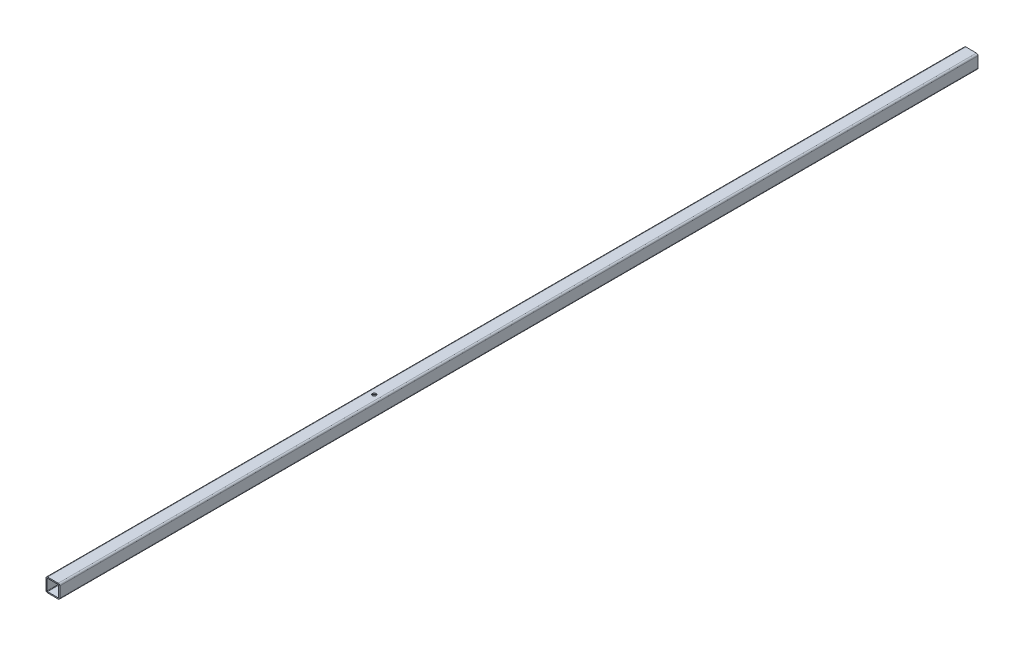
ISO-10303-21;
HEADER;
FILE_DESCRIPTION(('STEP AP214'),'2;1');
FILE_NAME('part.step','',(''),(''),'','','');
FILE_SCHEMA(('AUTOMOTIVE_DESIGN { 1 0 10303 214 1 1 1 1 }'));
ENDSEC;
DATA;
#1=APPLICATION_CONTEXT('core data for automotive mechanical design processes');
#2=APPLICATION_PROTOCOL_DEFINITION('international standard','automotive_design',2000,#1);
#3=PRODUCT_CONTEXT('',#1,'mechanical');
#4=PRODUCT('Part','Part','',(#3));
#5=PRODUCT_RELATED_PRODUCT_CATEGORY('part','',(#4));
#6=PRODUCT_DEFINITION_FORMATION('','',#4);
#7=PRODUCT_DEFINITION_CONTEXT('part definition',#1,'design');
#8=PRODUCT_DEFINITION('design','',#6,#7);
#9=PRODUCT_DEFINITION_SHAPE('','',#8);
#10=(LENGTH_UNIT() NAMED_UNIT(*) SI_UNIT(.MILLI.,.METRE.));
#11=(NAMED_UNIT(*) PLANE_ANGLE_UNIT() SI_UNIT($,.RADIAN.));
#12=(NAMED_UNIT(*) SI_UNIT($,.STERADIAN.) SOLID_ANGLE_UNIT());
#13=UNCERTAINTY_MEASURE_WITH_UNIT(LENGTH_MEASURE(1.E-05),#10,'distance_accuracy_value','');
#14=(GEOMETRIC_REPRESENTATION_CONTEXT(3) GLOBAL_UNCERTAINTY_ASSIGNED_CONTEXT((#13)) GLOBAL_UNIT_ASSIGNED_CONTEXT((#10,
#11,#12)) REPRESENTATION_CONTEXT('',''));
#15=CARTESIAN_POINT('',(0.,0.,0.));
#16=DIRECTION('',(0.,0.,1.));
#17=DIRECTION('',(1.,0.,0.));
#18=AXIS2_PLACEMENT_3D('',#15,#16,#17);
#19=CARTESIAN_POINT('',(-5.80000000000002,5.79999999999996,1000.));
#20=DIRECTION('',(0.,0.,1.));
#21=DIRECTION('',(1.,0.,0.));
#22=AXIS2_PLACEMENT_3D('',#19,#20,#21);
#23=PLANE('',#22);
#24=CARTESIAN_POINT('',(-5.80000000000002,5.79999999999996,1000.));
#25=DIRECTION('',(0.,0.,1.));
#26=DIRECTION('',(1.,0.,0.));
#27=AXIS2_PLACEMENT_3D('',#24,#25,#26);
#28=CIRCLE('',#27,1.7);
#29=CARTESIAN_POINT('',(-5.80000000000003,7.49999999999995,1000.));
#30=VERTEX_POINT('',#29);
#31=CARTESIAN_POINT('',(-7.50000000000002,5.79999999999995,1000.));
#32=VERTEX_POINT('',#31);
#33=EDGE_CURVE('E214',#30,#32,#28,.T.);
#34=ORIENTED_EDGE('',*,*,#33,.T.);
#35=DIRECTION('',(0.,-1.,0.));
#36=VECTOR('',#35,1.);
#37=CARTESIAN_POINT('',(-7.50000000000002,5.79999999999995,1000.));
#38=LINE('',#37,#36);
#39=CARTESIAN_POINT('',(-7.49999999999998,-5.79999999999995,1000.));
#40=VERTEX_POINT('',#39);
#41=EDGE_CURVE('E217',#32,#40,#38,.T.);
#42=ORIENTED_EDGE('',*,*,#41,.T.);
#43=CARTESIAN_POINT('',(-5.79999999999987,-5.79999999999994,1000.));
#44=DIRECTION('',(0.,0.,1.));
#45=DIRECTION('',(1.,0.,0.));
#46=AXIS2_PLACEMENT_3D('',#43,#44,#45);
#47=CIRCLE('',#46,1.70000000000011);
#48=CARTESIAN_POINT('',(-5.79999999999987,-7.50000000000005,1000.));
#49=VERTEX_POINT('',#48);
#50=EDGE_CURVE('E220',#40,#49,#47,.T.);
#51=ORIENTED_EDGE('',*,*,#50,.T.);
#52=DIRECTION('',(1.,0.,0.));
#53=VECTOR('',#52,1.);
#54=CARTESIAN_POINT('',(-5.79999999999987,-7.50000000000005,1000.));
#55=LINE('',#54,#53);
#56=CARTESIAN_POINT('',(5.7999999999999,-7.50000000000001,1000.));
#57=VERTEX_POINT('',#56);
#58=EDGE_CURVE('E222',#49,#57,#55,.T.);
#59=ORIENTED_EDGE('',*,*,#58,.T.);
#60=CARTESIAN_POINT('',(5.79999999999991,-5.7999999999999,1000.));
#61=DIRECTION('',(0.,0.,1.));
#62=DIRECTION('',(1.,0.,0.));
#63=AXIS2_PLACEMENT_3D('',#60,#61,#62);
#64=CIRCLE('',#63,1.70000000000011);
#65=CARTESIAN_POINT('',(7.50000000000002,-5.79999999999988,1000.));
#66=VERTEX_POINT('',#65);
#67=EDGE_CURVE('E224',#57,#66,#64,.T.);
#68=ORIENTED_EDGE('',*,*,#67,.T.);
#69=DIRECTION('',(0.,1.,0.));
#70=VECTOR('',#69,1.);
#71=CARTESIAN_POINT('',(7.49999999999997,5.8,1000.));
#72=LINE('',#71,#70);
#73=CARTESIAN_POINT('',(7.49999999999998,5.8,1000.));
#74=VERTEX_POINT('',#73);
#75=EDGE_CURVE('E226',#66,#74,#72,.T.);
#76=ORIENTED_EDGE('',*,*,#75,.T.);
#77=CARTESIAN_POINT('',(5.79999999999998,5.8,1000.));
#78=DIRECTION('',(0.,0.,1.));
#79=DIRECTION('',(-1.,0.,0.));
#80=AXIS2_PLACEMENT_3D('',#77,#78,#79);
#81=CIRCLE('',#80,1.7);
#82=CARTESIAN_POINT('',(5.79999999999997,7.5,1000.));
#83=VERTEX_POINT('',#82);
#84=EDGE_CURVE('E228',#74,#83,#81,.T.);
#85=ORIENTED_EDGE('',*,*,#84,.T.);
#86=DIRECTION('',(-1.,0.,0.));
#87=VECTOR('',#86,1.);
#88=CARTESIAN_POINT('',(-5.80000000000003,7.49999999999995,1000.));
#89=LINE('',#88,#87);
#90=EDGE_CURVE('E230',#83,#30,#89,.T.);
#91=ORIENTED_EDGE('',*,*,#90,.T.);
#92=EDGE_LOOP('',(#34,#42,#51,#59,#68,#76,#85,#91));
#93=FACE_BOUND('',#92,.T.);
#94=DIRECTION('',(0.,-1.,0.));
#95=VECTOR('',#94,1.);
#96=CARTESIAN_POINT('',(-6.29999999999991,5.79999999999995,1000.));
#97=LINE('',#96,#95);
#98=CARTESIAN_POINT('',(-6.29999999999991,5.79999999999995,1000.));
#99=VERTEX_POINT('',#98);
#100=CARTESIAN_POINT('',(-6.29999999999986,-5.79999999999995,1000.));
#101=VERTEX_POINT('',#100);
#102=EDGE_CURVE('E155',#99,#101,#97,.T.);
#103=ORIENTED_EDGE('',*,*,#102,.F.);
#104=CARTESIAN_POINT('',(-5.79999999999991,5.79999999999995,1000.));
#105=DIRECTION('',(0.,0.,1.));
#106=DIRECTION('',(-1.,0.,0.));
#107=AXIS2_PLACEMENT_3D('',#104,#105,#106);
#108=CIRCLE('',#107,0.500000000000001);
#109=CARTESIAN_POINT('',(-5.79999999999982,6.29999999999995,1000.));
#110=VERTEX_POINT('',#109);
#111=EDGE_CURVE('E147',#110,#99,#108,.T.);
#112=ORIENTED_EDGE('',*,*,#111,.F.);
#113=DIRECTION('',(-1.,0.,0.));
#114=VECTOR('',#113,1.);
#115=CARTESIAN_POINT('',(5.79999999999987,6.29999999999999,1000.));
#116=LINE('',#115,#114);
#117=CARTESIAN_POINT('',(5.79999999999986,6.29999999999999,1000.));
#118=VERTEX_POINT('',#117);
#119=EDGE_CURVE('E181',#118,#110,#116,.T.);
#120=ORIENTED_EDGE('',*,*,#119,.F.);
#121=CARTESIAN_POINT('',(5.79999999999987,5.79999999999977,1000.));
#122=DIRECTION('',(0.,0.,1.));
#123=DIRECTION('',(-1.,0.,0.));
#124=AXIS2_PLACEMENT_3D('',#121,#122,#123);
#125=CIRCLE('',#124,0.500000000000359);
#126=CARTESIAN_POINT('',(6.30000000000036,5.79999999999941,1000.));
#127=VERTEX_POINT('',#126);
#128=EDGE_CURVE('E179',#127,#118,#125,.T.);
#129=ORIENTED_EDGE('',*,*,#128,.F.);
#130=DIRECTION('',(0.,1.,0.));
#131=VECTOR('',#130,1.);
#132=CARTESIAN_POINT('',(6.30000000000041,-5.79999999999941,1000.));
#133=LINE('',#132,#131);
#134=CARTESIAN_POINT('',(6.30000000000027,-5.79999999999941,1000.));
#135=VERTEX_POINT('',#134);
#136=EDGE_CURVE('E177',#135,#127,#133,.T.);
#137=ORIENTED_EDGE('',*,*,#136,.F.);
#138=CARTESIAN_POINT('',(5.79999999999998,-5.79999999999978,1000.));
#139=DIRECTION('',(0.,0.,1.));
#140=DIRECTION('',(1.,0.,0.));
#141=AXIS2_PLACEMENT_3D('',#138,#139,#140);
#142=CIRCLE('',#141,0.500000000000293);
#143=CARTESIAN_POINT('',(5.79999999999998,-6.29999999999993,1000.));
#144=VERTEX_POINT('',#143);
#145=EDGE_CURVE('E175',#144,#135,#142,.T.);
#146=ORIENTED_EDGE('',*,*,#145,.F.);
#147=DIRECTION('',(1.,0.,0.));
#148=VECTOR('',#147,1.);
#149=CARTESIAN_POINT('',(-5.79999999999994,-6.29999999999997,1000.));
#150=LINE('',#149,#148);
#151=CARTESIAN_POINT('',(-5.79999999999994,-6.29999999999997,1000.));
#152=VERTEX_POINT('',#151);
#153=EDGE_CURVE('E170',#152,#144,#150,.T.);
#154=ORIENTED_EDGE('',*,*,#153,.F.);
#155=CARTESIAN_POINT('',(-5.79999999999994,-5.80000000000004,1000.));
#156=DIRECTION('',(0.,0.,1.));
#157=DIRECTION('',(-1.,0.,0.));
#158=AXIS2_PLACEMENT_3D('',#155,#156,#157);
#159=CIRCLE('',#158,0.499999999999926);
#160=EDGE_CURVE('E168',#101,#152,#159,.T.);
#161=ORIENTED_EDGE('',*,*,#160,.F.);
#162=EDGE_LOOP('',(#103,#112,#120,#129,#137,#146,#154,#161));
#163=FACE_BOUND('',#162,.T.);
#164=ADVANCED_FACE('F32',(#93,#163),#23,.T.);
#165=CARTESIAN_POINT('',(-5.80000000000002,5.79999999999996,0.));
#166=DIRECTION('',(0.,0.,1.));
#167=DIRECTION('',(1.,0.,0.));
#168=AXIS2_PLACEMENT_3D('',#165,#166,#167);
#169=PLANE('',#168);
#170=CARTESIAN_POINT('',(-5.80000000000002,5.79999999999996,0.));
#171=DIRECTION('',(0.,0.,1.));
#172=DIRECTION('',(1.,0.,0.));
#173=AXIS2_PLACEMENT_3D('',#170,#171,#172);
#174=CIRCLE('',#173,1.7);
#175=CARTESIAN_POINT('',(-5.80000000000003,7.49999999999995,0.));
#176=VERTEX_POINT('',#175);
#177=CARTESIAN_POINT('',(-7.50000000000002,5.79999999999995,0.));
#178=VERTEX_POINT('',#177);
#179=EDGE_CURVE('E163',#176,#178,#174,.T.);
#180=ORIENTED_EDGE('',*,*,#179,.F.);
#181=DIRECTION('',(-1.,0.,0.));
#182=VECTOR('',#181,1.);
#183=CARTESIAN_POINT('',(-5.80000000000003,7.49999999999995,0.));
#184=LINE('',#183,#182);
#185=CARTESIAN_POINT('',(5.79999999999997,7.5,0.));
#186=VERTEX_POINT('',#185);
#187=EDGE_CURVE('E218',#186,#176,#184,.T.);
#188=ORIENTED_EDGE('',*,*,#187,.F.);
#189=CARTESIAN_POINT('',(5.79999999999998,5.8,0.));
#190=DIRECTION('',(0.,0.,1.));
#191=DIRECTION('',(-1.,0.,0.));
#192=AXIS2_PLACEMENT_3D('',#189,#190,#191);
#193=CIRCLE('',#192,1.7);
#194=CARTESIAN_POINT('',(7.49999999999998,5.8,0.));
#195=VERTEX_POINT('',#194);
#196=EDGE_CURVE('E245',#195,#186,#193,.T.);
#197=ORIENTED_EDGE('',*,*,#196,.F.);
#198=DIRECTION('',(0.,1.,0.));
#199=VECTOR('',#198,1.);
#200=CARTESIAN_POINT('',(7.49999999999997,5.8,0.));
#201=LINE('',#200,#199);
#202=CARTESIAN_POINT('',(7.50000000000002,-5.79999999999988,0.));
#203=VERTEX_POINT('',#202);
#204=EDGE_CURVE('E243',#203,#195,#201,.T.);
#205=ORIENTED_EDGE('',*,*,#204,.F.);
#206=CARTESIAN_POINT('',(5.79999999999991,-5.7999999999999,0.));
#207=DIRECTION('',(0.,0.,1.));
#208=DIRECTION('',(1.,0.,0.));
#209=AXIS2_PLACEMENT_3D('',#206,#207,#208);
#210=CIRCLE('',#209,1.70000000000011);
#211=CARTESIAN_POINT('',(5.7999999999999,-7.50000000000001,0.));
#212=VERTEX_POINT('',#211);
#213=EDGE_CURVE('E241',#212,#203,#210,.T.);
#214=ORIENTED_EDGE('',*,*,#213,.F.);
#215=DIRECTION('',(1.,0.,0.));
#216=VECTOR('',#215,1.);
#217=CARTESIAN_POINT('',(-5.79999999999987,-7.50000000000005,0.));
#218=LINE('',#217,#216);
#219=CARTESIAN_POINT('',(-5.79999999999987,-7.50000000000005,0.));
#220=VERTEX_POINT('',#219);
#221=EDGE_CURVE('E239',#220,#212,#218,.T.);
#222=ORIENTED_EDGE('',*,*,#221,.F.);
#223=CARTESIAN_POINT('',(-5.79999999999987,-5.79999999999994,0.));
#224=DIRECTION('',(0.,0.,1.));
#225=DIRECTION('',(1.,0.,0.));
#226=AXIS2_PLACEMENT_3D('',#223,#224,#225);
#227=CIRCLE('',#226,1.70000000000011);
#228=CARTESIAN_POINT('',(-7.49999999999998,-5.79999999999995,0.));
#229=VERTEX_POINT('',#228);
#230=EDGE_CURVE('E237',#229,#220,#227,.T.);
#231=ORIENTED_EDGE('',*,*,#230,.F.);
#232=DIRECTION('',(0.,-1.,0.));
#233=VECTOR('',#232,1.);
#234=CARTESIAN_POINT('',(-7.50000000000002,5.79999999999995,0.));
#235=LINE('',#234,#233);
#236=EDGE_CURVE('E235',#178,#229,#235,.T.);
#237=ORIENTED_EDGE('',*,*,#236,.F.);
#238=EDGE_LOOP('',(#180,#188,#197,#205,#214,#222,#231,#237));
#239=FACE_BOUND('',#238,.T.);
#240=CARTESIAN_POINT('',(-5.79999999999991,5.79999999999995,0.));
#241=DIRECTION('',(0.,0.,1.));
#242=DIRECTION('',(-1.,0.,0.));
#243=AXIS2_PLACEMENT_3D('',#240,#241,#242);
#244=CIRCLE('',#243,0.500000000000001);
#245=CARTESIAN_POINT('',(-5.79999999999982,6.29999999999995,0.));
#246=VERTEX_POINT('',#245);
#247=CARTESIAN_POINT('',(-6.29999999999991,5.79999999999995,0.));
#248=VERTEX_POINT('',#247);
#249=EDGE_CURVE('E57',#246,#248,#244,.T.);
#250=ORIENTED_EDGE('',*,*,#249,.T.);
#251=DIRECTION('',(0.,-1.,0.));
#252=VECTOR('',#251,1.);
#253=CARTESIAN_POINT('',(-6.29999999999991,5.79999999999995,0.));
#254=LINE('',#253,#252);
#255=CARTESIAN_POINT('',(-6.29999999999986,-5.79999999999995,0.));
#256=VERTEX_POINT('',#255);
#257=EDGE_CURVE('E162',#248,#256,#254,.T.);
#258=ORIENTED_EDGE('',*,*,#257,.T.);
#259=CARTESIAN_POINT('',(-5.79999999999994,-5.80000000000004,0.));
#260=DIRECTION('',(0.,0.,1.));
#261=DIRECTION('',(-1.,0.,0.));
#262=AXIS2_PLACEMENT_3D('',#259,#260,#261);
#263=CIRCLE('',#262,0.499999999999926);
#264=CARTESIAN_POINT('',(-5.79999999999994,-6.29999999999997,0.));
#265=VERTEX_POINT('',#264);
#266=EDGE_CURVE('E186',#256,#265,#263,.T.);
#267=ORIENTED_EDGE('',*,*,#266,.T.);
#268=DIRECTION('',(1.,0.,0.));
#269=VECTOR('',#268,1.);
#270=CARTESIAN_POINT('',(-5.79999999999994,-6.29999999999997,0.));
#271=LINE('',#270,#269);
#272=CARTESIAN_POINT('',(5.79999999999998,-6.29999999999993,0.));
#273=VERTEX_POINT('',#272);
#274=EDGE_CURVE('E189',#265,#273,#271,.T.);
#275=ORIENTED_EDGE('',*,*,#274,.T.);
#276=CARTESIAN_POINT('',(5.79999999999998,-5.79999999999978,0.));
#277=DIRECTION('',(0.,0.,1.));
#278=DIRECTION('',(1.,0.,0.));
#279=AXIS2_PLACEMENT_3D('',#276,#277,#278);
#280=CIRCLE('',#279,0.500000000000293);
#281=CARTESIAN_POINT('',(6.30000000000027,-5.79999999999941,0.));
#282=VERTEX_POINT('',#281);
#283=EDGE_CURVE('E192',#273,#282,#280,.T.);
#284=ORIENTED_EDGE('',*,*,#283,.T.);
#285=DIRECTION('',(0.,1.,0.));
#286=VECTOR('',#285,1.);
#287=CARTESIAN_POINT('',(6.30000000000041,-5.79999999999941,0.));
#288=LINE('',#287,#286);
#289=CARTESIAN_POINT('',(6.30000000000036,5.79999999999941,0.));
#290=VERTEX_POINT('',#289);
#291=EDGE_CURVE('E195',#282,#290,#288,.T.);
#292=ORIENTED_EDGE('',*,*,#291,.T.);
#293=CARTESIAN_POINT('',(5.79999999999987,5.79999999999977,0.));
#294=DIRECTION('',(0.,0.,1.));
#295=DIRECTION('',(-1.,0.,0.));
#296=AXIS2_PLACEMENT_3D('',#293,#294,#295);
#297=CIRCLE('',#296,0.500000000000359);
#298=CARTESIAN_POINT('',(5.79999999999987,6.30000000000013,0.));
#299=VERTEX_POINT('',#298);
#300=EDGE_CURVE('E198',#290,#299,#297,.T.);
#301=ORIENTED_EDGE('',*,*,#300,.T.);
#302=DIRECTION('',(-1.,0.,0.));
#303=VECTOR('',#302,1.);
#304=CARTESIAN_POINT('',(5.79999999999987,6.29999999999999,0.));
#305=LINE('',#304,#303);
#306=EDGE_CURVE('E156',#299,#246,#305,.T.);
#307=ORIENTED_EDGE('',*,*,#306,.T.);
#308=EDGE_LOOP('',(#250,#258,#267,#275,#284,#292,#301,#307));
#309=FACE_BOUND('',#308,.T.);
#310=ADVANCED_FACE('F296',(#239,#309),#169,.F.);
#311=CARTESIAN_POINT('',(-5.80000000000002,5.79999999999996,1000.));
#312=DIRECTION('',(0.,0.,-1.));
#313=DIRECTION('',(-1.,0.,0.));
#314=AXIS2_PLACEMENT_3D('',#311,#312,#313);
#315=CYLINDRICAL_SURFACE('',#314,1.7);
#316=ORIENTED_EDGE('',*,*,#179,.T.);
#317=DIRECTION('',(0.,0.,-1.));
#318=VECTOR('',#317,1.);
#319=CARTESIAN_POINT('',(-7.50000000000002,5.79999999999995,1000.));
#320=LINE('',#319,#318);
#321=EDGE_CURVE('E11',#32,#178,#320,.T.);
#322=ORIENTED_EDGE('',*,*,#321,.F.);
#323=ORIENTED_EDGE('',*,*,#33,.F.);
#324=DIRECTION('',(0.,0.,-1.));
#325=VECTOR('',#324,1.);
#326=CARTESIAN_POINT('',(-5.80000000000003,7.49999999999995,1000.));
#327=LINE('',#326,#325);
#328=EDGE_CURVE('E232',#30,#176,#327,.T.);
#329=ORIENTED_EDGE('',*,*,#328,.T.);
#330=EDGE_LOOP('',(#316,#322,#323,#329));
#331=FACE_BOUND('',#330,.T.);
#332=ADVANCED_FACE('F34',(#331),#315,.T.);
#333=CARTESIAN_POINT('',(-7.50000000000002,5.79999999999995,1000.));
#334=DIRECTION('',(1.,0.,0.));
#335=DIRECTION('',(0.,1.,0.));
#336=AXIS2_PLACEMENT_3D('',#333,#334,#335);
#337=PLANE('',#336);
#338=CARTESIAN_POINT('',(-7.5,0.,697.));
#339=DIRECTION('',(-1.,0.,0.));
#340=DIRECTION('',(0.,-1.,0.));
#341=AXIS2_PLACEMENT_3D('',#338,#339,#340);
#342=CIRCLE('',#341,2.);
#343=CARTESIAN_POINT('',(-7.49999999999999,-2.00000000000005,697.));
#344=VERTEX_POINT('',#343);
#345=EDGE_CURVE('E267',#344,#344,#342,.T.);
#346=ORIENTED_EDGE('',*,*,#345,.F.);
#347=EDGE_LOOP('',(#346));
#348=FACE_BOUND('',#347,.T.);
#349=ORIENTED_EDGE('',*,*,#236,.T.);
#350=DIRECTION('',(0.,0.,-1.));
#351=VECTOR('',#350,1.);
#352=CARTESIAN_POINT('',(-7.49999999999998,-5.79999999999995,1000.));
#353=LINE('',#352,#351);
#354=EDGE_CURVE('E41',#40,#229,#353,.T.);
#355=ORIENTED_EDGE('',*,*,#354,.F.);
#356=ORIENTED_EDGE('',*,*,#41,.F.);
#357=ORIENTED_EDGE('',*,*,#321,.T.);
#358=EDGE_LOOP('',(#349,#355,#356,#357));
#359=FACE_BOUND('',#358,.T.);
#360=ADVANCED_FACE('F302',(#348,#359),#337,.F.);
#361=CARTESIAN_POINT('',(-5.79999999999987,-5.79999999999994,1000.));
#362=DIRECTION('',(0.,0.,-1.));
#363=DIRECTION('',(-1.,0.,0.));
#364=AXIS2_PLACEMENT_3D('',#361,#362,#363);
#365=CYLINDRICAL_SURFACE('',#364,1.70000000000011);
#366=ORIENTED_EDGE('',*,*,#230,.T.);
#367=DIRECTION('',(0.,0.,-1.));
#368=VECTOR('',#367,1.);
#369=CARTESIAN_POINT('',(-5.79999999999987,-7.50000000000005,1000.));
#370=LINE('',#369,#368);
#371=EDGE_CURVE('E262',#49,#220,#370,.T.);
#372=ORIENTED_EDGE('',*,*,#371,.F.);
#373=ORIENTED_EDGE('',*,*,#50,.F.);
#374=ORIENTED_EDGE('',*,*,#354,.T.);
#375=EDGE_LOOP('',(#366,#372,#373,#374));
#376=FACE_BOUND('',#375,.T.);
#377=ADVANCED_FACE('F323',(#376),#365,.T.);
#378=CARTESIAN_POINT('',(-5.79999999999987,-7.50000000000005,1000.));
#379=DIRECTION('',(0.,1.,0.));
#380=DIRECTION('',(-1.,0.,0.));
#381=AXIS2_PLACEMENT_3D('',#378,#379,#380);
#382=PLANE('',#381);
#383=ORIENTED_EDGE('',*,*,#221,.T.);
#384=DIRECTION('',(0.,0.,-1.));
#385=VECTOR('',#384,1.);
#386=CARTESIAN_POINT('',(5.7999999999999,-7.50000000000001,1000.));
#387=LINE('',#386,#385);
#388=EDGE_CURVE('E259',#57,#212,#387,.T.);
#389=ORIENTED_EDGE('',*,*,#388,.F.);
#390=ORIENTED_EDGE('',*,*,#58,.F.);
#391=ORIENTED_EDGE('',*,*,#371,.T.);
#392=EDGE_LOOP('',(#383,#389,#390,#391));
#393=FACE_BOUND('',#392,.T.);
#394=ADVANCED_FACE('F320',(#393),#382,.F.);
#395=CARTESIAN_POINT('',(5.79999999999991,-5.7999999999999,1000.));
#396=DIRECTION('',(0.,0.,-1.));
#397=DIRECTION('',(-1.,0.,0.));
#398=AXIS2_PLACEMENT_3D('',#395,#396,#397);
#399=CYLINDRICAL_SURFACE('',#398,1.70000000000011);
#400=ORIENTED_EDGE('',*,*,#213,.T.);
#401=DIRECTION('',(0.,0.,-1.));
#402=VECTOR('',#401,1.);
#403=CARTESIAN_POINT('',(7.50000000000002,-5.79999999999988,1000.));
#404=LINE('',#403,#402);
#405=EDGE_CURVE('E256',#66,#203,#404,.T.);
#406=ORIENTED_EDGE('',*,*,#405,.F.);
#407=ORIENTED_EDGE('',*,*,#67,.F.);
#408=ORIENTED_EDGE('',*,*,#388,.T.);
#409=EDGE_LOOP('',(#400,#406,#407,#408));
#410=FACE_BOUND('',#409,.T.);
#411=ADVANCED_FACE('F316',(#410),#399,.T.);
#412=CARTESIAN_POINT('',(7.49999999999997,5.8,1000.));
#413=DIRECTION('',(-1.,0.,0.));
#414=DIRECTION('',(0.,-1.,0.));
#415=AXIS2_PLACEMENT_3D('',#412,#413,#414);
#416=PLANE('',#415);
#417=ORIENTED_EDGE('',*,*,#204,.T.);
#418=DIRECTION('',(0.,0.,-1.));
#419=VECTOR('',#418,1.);
#420=CARTESIAN_POINT('',(7.49999999999998,5.8,1000.));
#421=LINE('',#420,#419);
#422=EDGE_CURVE('E253',#74,#195,#421,.T.);
#423=ORIENTED_EDGE('',*,*,#422,.F.);
#424=ORIENTED_EDGE('',*,*,#75,.F.);
#425=ORIENTED_EDGE('',*,*,#405,.T.);
#426=EDGE_LOOP('',(#417,#423,#424,#425));
#427=FACE_BOUND('',#426,.T.);
#428=ADVANCED_FACE('F312',(#427),#416,.F.);
#429=CARTESIAN_POINT('',(5.79999999999998,5.8,1000.));
#430=DIRECTION('',(0.,0.,-1.));
#431=DIRECTION('',(-1.,0.,0.));
#432=AXIS2_PLACEMENT_3D('',#429,#430,#431);
#433=CYLINDRICAL_SURFACE('',#432,1.7);
#434=ORIENTED_EDGE('',*,*,#196,.T.);
#435=DIRECTION('',(0.,0.,-1.));
#436=VECTOR('',#435,1.);
#437=CARTESIAN_POINT('',(5.79999999999997,7.5,1000.));
#438=LINE('',#437,#436);
#439=EDGE_CURVE('E250',#83,#186,#438,.T.);
#440=ORIENTED_EDGE('',*,*,#439,.F.);
#441=ORIENTED_EDGE('',*,*,#84,.F.);
#442=ORIENTED_EDGE('',*,*,#422,.T.);
#443=EDGE_LOOP('',(#434,#440,#441,#442));
#444=FACE_BOUND('',#443,.T.);
#445=ADVANCED_FACE('F284',(#444),#433,.T.);
#446=CARTESIAN_POINT('',(-5.80000000000003,7.49999999999995,1000.));
#447=DIRECTION('',(0.,-1.,0.));
#448=DIRECTION('',(1.,0.,0.));
#449=AXIS2_PLACEMENT_3D('',#446,#447,#448);
#450=PLANE('',#449);
#451=CARTESIAN_POINT('',(0.,7.49999999999998,650.));
#452=DIRECTION('',(0.,1.,0.));
#453=DIRECTION('',(-1.,0.,0.));
#454=AXIS2_PLACEMENT_3D('',#451,#452,#453);
#455=CIRCLE('',#454,2.00000000000001);
#456=CARTESIAN_POINT('',(-2.00000000000007,7.49999999999997,650.));
#457=VERTEX_POINT('',#456);
#458=EDGE_CURVE('E274',#457,#457,#455,.T.);
#459=ORIENTED_EDGE('',*,*,#458,.F.);
#460=EDGE_LOOP('',(#459));
#461=FACE_BOUND('',#460,.T.);
#462=ORIENTED_EDGE('',*,*,#187,.T.);
#463=ORIENTED_EDGE('',*,*,#328,.F.);
#464=ORIENTED_EDGE('',*,*,#90,.F.);
#465=ORIENTED_EDGE('',*,*,#439,.T.);
#466=EDGE_LOOP('',(#462,#463,#464,#465));
#467=FACE_BOUND('',#466,.T.);
#468=ADVANCED_FACE('F281',(#461,#467),#450,.F.);
#469=CARTESIAN_POINT('',(-5.79999999999991,5.79999999999995,1000.));
#470=DIRECTION('',(0.,0.,-1.));
#471=DIRECTION('',(-1.,0.,0.));
#472=AXIS2_PLACEMENT_3D('',#469,#470,#471);
#473=CYLINDRICAL_SURFACE('',#472,0.500000000000001);
#474=ORIENTED_EDGE('',*,*,#249,.F.);
#475=DIRECTION('',(0.,0.,-1.));
#476=VECTOR('',#475,1.);
#477=CARTESIAN_POINT('',(-5.79999999999982,6.29999999999995,1000.));
#478=LINE('',#477,#476);
#479=EDGE_CURVE('E151',#110,#246,#478,.T.);
#480=ORIENTED_EDGE('',*,*,#479,.F.);
#481=ORIENTED_EDGE('',*,*,#111,.T.);
#482=DIRECTION('',(0.,0.,-1.));
#483=VECTOR('',#482,1.);
#484=CARTESIAN_POINT('',(-6.29999999999991,5.79999999999995,1000.));
#485=LINE('',#484,#483);
#486=EDGE_CURVE('E150',#99,#248,#485,.T.);
#487=ORIENTED_EDGE('',*,*,#486,.T.);
#488=EDGE_LOOP('',(#474,#480,#481,#487));
#489=FACE_BOUND('',#488,.T.);
#490=ADVANCED_FACE('F149',(#489),#473,.F.);
#491=CARTESIAN_POINT('',(-6.29999999999991,5.79999999999995,1000.));
#492=DIRECTION('',(1.,0.,0.));
#493=DIRECTION('',(0.,1.,0.));
#494=AXIS2_PLACEMENT_3D('',#491,#492,#493);
#495=PLANE('',#494);
#496=CARTESIAN_POINT('',(-6.29999999999989,0.,697.));
#497=DIRECTION('',(1.,0.,0.));
#498=DIRECTION('',(0.,1.,0.));
#499=AXIS2_PLACEMENT_3D('',#496,#497,#498);
#500=CIRCLE('',#499,2.);
#501=CARTESIAN_POINT('',(-6.29999999999989,1.99999999999994,697.));
#502=VERTEX_POINT('',#501);
#503=EDGE_CURVE('E184',#502,#502,#500,.T.);
#504=ORIENTED_EDGE('',*,*,#503,.F.);
#505=EDGE_LOOP('',(#504));
#506=FACE_BOUND('',#505,.T.);
#507=ORIENTED_EDGE('',*,*,#257,.F.);
#508=ORIENTED_EDGE('',*,*,#486,.F.);
#509=ORIENTED_EDGE('',*,*,#102,.T.);
#510=DIRECTION('',(0.,0.,-1.));
#511=VECTOR('',#510,1.);
#512=CARTESIAN_POINT('',(-6.29999999999986,-5.79999999999995,1000.));
#513=LINE('',#512,#511);
#514=EDGE_CURVE('E164',#101,#256,#513,.T.);
#515=ORIENTED_EDGE('',*,*,#514,.T.);
#516=EDGE_LOOP('',(#507,#508,#509,#515));
#517=FACE_BOUND('',#516,.T.);
#518=ADVANCED_FACE('F159',(#506,#517),#495,.T.);
#519=CARTESIAN_POINT('',(-5.79999999999994,-5.80000000000004,1000.));
#520=DIRECTION('',(0.,0.,-1.));
#521=DIRECTION('',(-1.,0.,0.));
#522=AXIS2_PLACEMENT_3D('',#519,#520,#521);
#523=CYLINDRICAL_SURFACE('',#522,0.499999999999926);
#524=ORIENTED_EDGE('',*,*,#266,.F.);
#525=ORIENTED_EDGE('',*,*,#514,.F.);
#526=ORIENTED_EDGE('',*,*,#160,.T.);
#527=DIRECTION('',(0.,0.,-1.));
#528=VECTOR('',#527,1.);
#529=CARTESIAN_POINT('',(-5.79999999999994,-6.29999999999997,1000.));
#530=LINE('',#529,#528);
#531=EDGE_CURVE('E211',#152,#265,#530,.T.);
#532=ORIENTED_EDGE('',*,*,#531,.T.);
#533=EDGE_LOOP('',(#524,#525,#526,#532));
#534=FACE_BOUND('',#533,.T.);
#535=ADVANCED_FACE('F376',(#534),#523,.F.);
#536=CARTESIAN_POINT('',(-5.79999999999994,-6.29999999999997,1000.));
#537=DIRECTION('',(0.,1.,0.));
#538=DIRECTION('',(-1.,0.,0.));
#539=AXIS2_PLACEMENT_3D('',#536,#537,#538);
#540=PLANE('',#539);
#541=ORIENTED_EDGE('',*,*,#274,.F.);
#542=ORIENTED_EDGE('',*,*,#531,.F.);
#543=ORIENTED_EDGE('',*,*,#153,.T.);
#544=DIRECTION('',(0.,0.,-1.));
#545=VECTOR('',#544,1.);
#546=CARTESIAN_POINT('',(5.79999999999998,-6.29999999999993,1000.));
#547=LINE('',#546,#545);
#548=EDGE_CURVE('E209',#144,#273,#547,.T.);
#549=ORIENTED_EDGE('',*,*,#548,.T.);
#550=EDGE_LOOP('',(#541,#542,#543,#549));
#551=FACE_BOUND('',#550,.T.);
#552=ADVANCED_FACE('F383',(#551),#540,.T.);
#553=CARTESIAN_POINT('',(5.79999999999998,-5.79999999999978,1000.));
#554=DIRECTION('',(0.,0.,-1.));
#555=DIRECTION('',(-1.,0.,0.));
#556=AXIS2_PLACEMENT_3D('',#553,#554,#555);
#557=CYLINDRICAL_SURFACE('',#556,0.500000000000293);
#558=ORIENTED_EDGE('',*,*,#283,.F.);
#559=ORIENTED_EDGE('',*,*,#548,.F.);
#560=ORIENTED_EDGE('',*,*,#145,.T.);
#561=DIRECTION('',(0.,0.,-1.));
#562=VECTOR('',#561,1.);
#563=CARTESIAN_POINT('',(6.30000000000027,-5.79999999999941,1000.));
#564=LINE('',#563,#562);
#565=EDGE_CURVE('E207',#135,#282,#564,.T.);
#566=ORIENTED_EDGE('',*,*,#565,.T.);
#567=EDGE_LOOP('',(#558,#559,#560,#566));
#568=FACE_BOUND('',#567,.T.);
#569=ADVANCED_FACE('F391',(#568),#557,.F.);
#570=CARTESIAN_POINT('',(6.30000000000041,-5.79999999999941,1000.));
#571=DIRECTION('',(-1.,0.,0.));
#572=DIRECTION('',(0.,-1.,0.));
#573=AXIS2_PLACEMENT_3D('',#570,#571,#572);
#574=PLANE('',#573);
#575=ORIENTED_EDGE('',*,*,#291,.F.);
#576=ORIENTED_EDGE('',*,*,#565,.F.);
#577=ORIENTED_EDGE('',*,*,#136,.T.);
#578=DIRECTION('',(0.,0.,-1.));
#579=VECTOR('',#578,1.);
#580=CARTESIAN_POINT('',(6.30000000000036,5.79999999999941,1000.));
#581=LINE('',#580,#579);
#582=EDGE_CURVE('E205',#127,#290,#581,.T.);
#583=ORIENTED_EDGE('',*,*,#582,.T.);
#584=EDGE_LOOP('',(#575,#576,#577,#583));
#585=FACE_BOUND('',#584,.T.);
#586=ADVANCED_FACE('F399',(#585),#574,.T.);
#587=CARTESIAN_POINT('',(5.79999999999987,5.79999999999977,1000.));
#588=DIRECTION('',(0.,0.,-1.));
#589=DIRECTION('',(-1.,0.,0.));
#590=AXIS2_PLACEMENT_3D('',#587,#588,#589);
#591=CYLINDRICAL_SURFACE('',#590,0.500000000000359);
#592=ORIENTED_EDGE('',*,*,#300,.F.);
#593=ORIENTED_EDGE('',*,*,#582,.F.);
#594=ORIENTED_EDGE('',*,*,#128,.T.);
#595=DIRECTION('',(0.,0.,-1.));
#596=VECTOR('',#595,1.);
#597=CARTESIAN_POINT('',(5.79999999999987,6.30000000000013,1000.));
#598=LINE('',#597,#596);
#599=EDGE_CURVE('E49',#118,#299,#598,.T.);
#600=ORIENTED_EDGE('',*,*,#599,.T.);
#601=EDGE_LOOP('',(#592,#593,#594,#600));
#602=FACE_BOUND('',#601,.T.);
#603=ADVANCED_FACE('F407',(#602),#591,.F.);
#604=CARTESIAN_POINT('',(5.79999999999987,6.29999999999999,1000.));
#605=DIRECTION('',(0.,-1.,0.));
#606=DIRECTION('',(1.,0.,0.));
#607=AXIS2_PLACEMENT_3D('',#604,#605,#606);
#608=PLANE('',#607);
#609=CARTESIAN_POINT('',(0.,6.29999999999997,650.));
#610=DIRECTION('',(0.,-1.,0.));
#611=DIRECTION('',(1.,0.,0.));
#612=AXIS2_PLACEMENT_3D('',#609,#610,#611);
#613=CIRCLE('',#612,2.00000000000001);
#614=CARTESIAN_POINT('',(1.99999999999994,6.29999999999998,650.));
#615=VERTEX_POINT('',#614);
#616=EDGE_CURVE('E36',#615,#615,#613,.T.);
#617=ORIENTED_EDGE('',*,*,#616,.F.);
#618=EDGE_LOOP('',(#617));
#619=FACE_BOUND('',#618,.T.);
#620=ORIENTED_EDGE('',*,*,#306,.F.);
#621=ORIENTED_EDGE('',*,*,#599,.F.);
#622=ORIENTED_EDGE('',*,*,#119,.T.);
#623=ORIENTED_EDGE('',*,*,#479,.T.);
#624=EDGE_LOOP('',(#620,#621,#622,#623));
#625=FACE_BOUND('',#624,.T.);
#626=ADVANCED_FACE('F415',(#619,#625),#608,.T.);
#627=CARTESIAN_POINT('',(-5.5,0.,697.));
#628=DIRECTION('',(-1.,0.,0.));
#629=DIRECTION('',(0.,-1.,0.));
#630=AXIS2_PLACEMENT_3D('',#627,#628,#629);
#631=CYLINDRICAL_SURFACE('',#630,2.);
#632=ORIENTED_EDGE('',*,*,#503,.T.);
#633=EDGE_LOOP('',(#632));
#634=FACE_BOUND('',#633,.T.);
#635=ORIENTED_EDGE('',*,*,#345,.T.);
#636=EDGE_LOOP('',(#635));
#637=FACE_BOUND('',#636,.T.);
#638=ADVANCED_FACE('F422',(#634,#637),#631,.F.);
#639=CARTESIAN_POINT('',(0.,5.49999999999998,650.));
#640=DIRECTION('',(0.,1.,0.));
#641=DIRECTION('',(-1.,0.,0.));
#642=AXIS2_PLACEMENT_3D('',#639,#640,#641);
#643=CYLINDRICAL_SURFACE('',#642,2.00000000000001);
#644=ORIENTED_EDGE('',*,*,#616,.T.);
#645=EDGE_LOOP('',(#644));
#646=FACE_BOUND('',#645,.T.);
#647=ORIENTED_EDGE('',*,*,#458,.T.);
#648=EDGE_LOOP('',(#647));
#649=FACE_BOUND('',#648,.T.);
#650=ADVANCED_FACE('F279',(#646,#649),#643,.F.);
#651=CLOSED_SHELL('',(#164,#310,#332,#360,#377,#394,#411,#428,#445,#468,#490,#518,#535,#552,
#569,#586,#603,#626,#638,#650));
#652=MANIFOLD_SOLID_BREP('B2',#651);
#653=ADVANCED_BREP_SHAPE_REPRESENTATION('',(#18,#652),#14);
#654=SHAPE_DEFINITION_REPRESENTATION(#9,#653);
ENDSEC;
END-ISO-10303-21;
